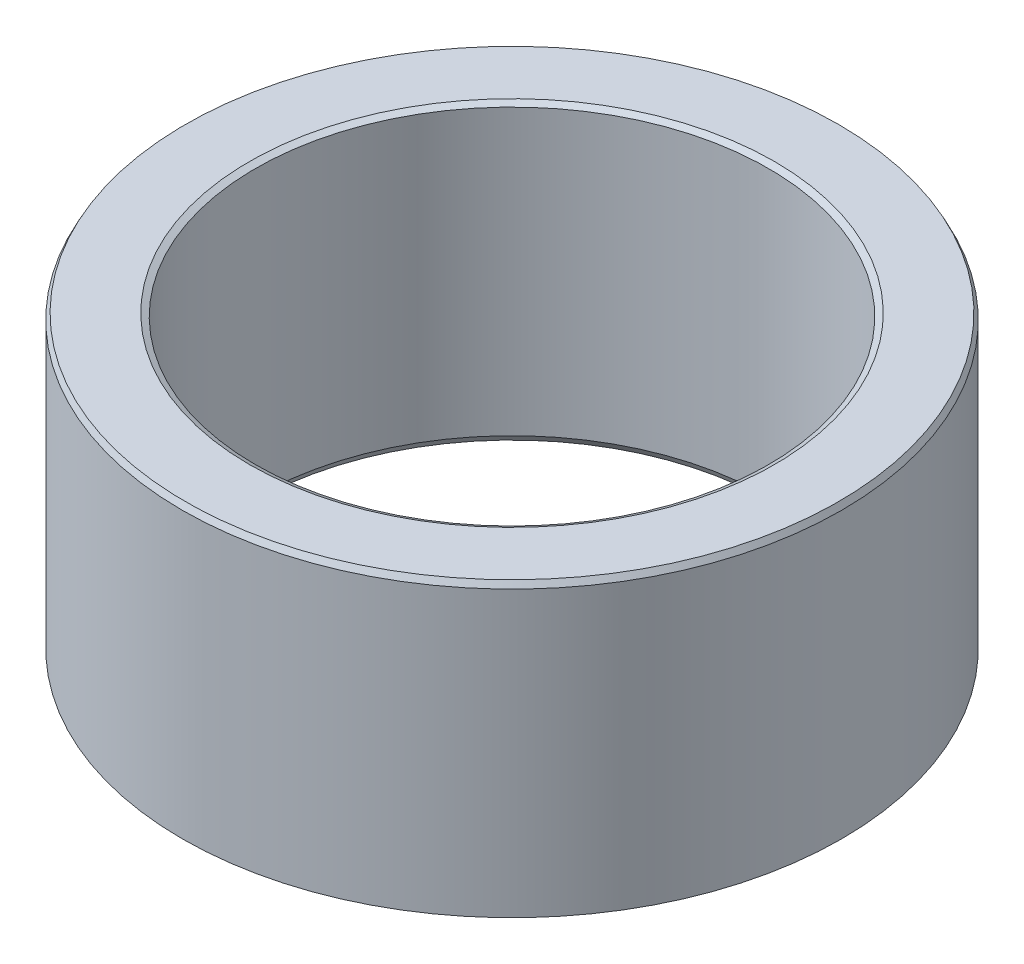
ISO-10303-21;
HEADER;
FILE_DESCRIPTION(('STEP AP214'),'2;1');
FILE_NAME('part.step','',(''),(''),'','','');
FILE_SCHEMA(('AUTOMOTIVE_DESIGN { 1 0 10303 214 1 1 1 1 }'));
ENDSEC;
DATA;
#1=APPLICATION_CONTEXT('core data for automotive mechanical design processes');
#2=APPLICATION_PROTOCOL_DEFINITION('international standard','automotive_design',2000,#1);
#3=PRODUCT_CONTEXT('',#1,'mechanical');
#4=PRODUCT('Part','Part','',(#3));
#5=PRODUCT_RELATED_PRODUCT_CATEGORY('part','',(#4));
#6=PRODUCT_DEFINITION_FORMATION('','',#4);
#7=PRODUCT_DEFINITION_CONTEXT('part definition',#1,'design');
#8=PRODUCT_DEFINITION('design','',#6,#7);
#9=PRODUCT_DEFINITION_SHAPE('','',#8);
#10=(LENGTH_UNIT() NAMED_UNIT(*) SI_UNIT(.MILLI.,.METRE.));
#11=(NAMED_UNIT(*) PLANE_ANGLE_UNIT() SI_UNIT($,.RADIAN.));
#12=(NAMED_UNIT(*) SI_UNIT($,.STERADIAN.) SOLID_ANGLE_UNIT());
#13=UNCERTAINTY_MEASURE_WITH_UNIT(LENGTH_MEASURE(1.E-05),#10,'distance_accuracy_value','');
#14=(GEOMETRIC_REPRESENTATION_CONTEXT(3) GLOBAL_UNCERTAINTY_ASSIGNED_CONTEXT((#13)) GLOBAL_UNIT_ASSIGNED_CONTEXT((#10,
#11,#12)) REPRESENTATION_CONTEXT('',''));
#15=CARTESIAN_POINT('',(0.,0.,0.));
#16=DIRECTION('',(0.,0.,1.));
#17=DIRECTION('',(1.,0.,0.));
#18=AXIS2_PLACEMENT_3D('',#15,#16,#17);
#19=CARTESIAN_POINT('',(0.,26.7156159370592,0.));
#20=DIRECTION('',(0.,-1.,0.));
#21=DIRECTION('',(0.,0.,-1.));
#22=AXIS2_PLACEMENT_3D('',#19,#20,#21);
#23=CYLINDRICAL_SURFACE('',#22,30.);
#24=CARTESIAN_POINT('',(0.,0.277808057925648,0.));
#25=DIRECTION('',(0.,1.,0.));
#26=DIRECTION('',(0.,0.,1.));
#27=AXIS2_PLACEMENT_3D('',#24,#25,#26);
#28=CIRCLE('',#27,30.);
#29=CARTESIAN_POINT('',(0.,0.277808057925648,30.));
#30=VERTEX_POINT('',#29);
#31=EDGE_CURVE('E10',#30,#30,#28,.T.);
#32=ORIENTED_EDGE('',*,*,#31,.T.);
#33=EDGE_LOOP('',(#32));
#34=FACE_BOUND('',#33,.T.);
#35=CARTESIAN_POINT('',(0.,26.1721010701166,0.));
#36=DIRECTION('',(0.,1.,0.));
#37=DIRECTION('',(0.,0.,1.));
#38=AXIS2_PLACEMENT_3D('',#35,#36,#37);
#39=CIRCLE('',#38,30.);
#40=CARTESIAN_POINT('',(0.,26.1721010701166,-30.));
#41=VERTEX_POINT('',#40);
#42=EDGE_CURVE('E50',#41,#41,#39,.F.);
#43=ORIENTED_EDGE('',*,*,#42,.T.);
#44=EDGE_LOOP('',(#43));
#45=FACE_BOUND('',#44,.T.);
#46=ADVANCED_FACE('F39',(#34,#45),#23,.T.);
#47=CARTESIAN_POINT('',(0.,26.7156159370592,0.));
#48=DIRECTION('',(0.,1.,0.));
#49=DIRECTION('',(0.,0.,1.));
#50=AXIS2_PLACEMENT_3D('',#47,#48,#49);
#51=PLANE('',#50);
#52=CARTESIAN_POINT('',(0.,26.7156159370592,0.));
#53=DIRECTION('',(0.,1.,0.));
#54=DIRECTION('',(0.,0.,1.));
#55=AXIS2_PLACEMENT_3D('',#52,#53,#54);
#56=CIRCLE('',#55,23.8874839392148);
#57=CARTESIAN_POINT('',(0.,26.7156159370592,23.8874839392148));
#58=VERTEX_POINT('',#57);
#59=EDGE_CURVE('E58',#58,#58,#56,.F.);
#60=ORIENTED_EDGE('',*,*,#59,.T.);
#61=EDGE_LOOP('',(#60));
#62=FACE_BOUND('',#61,.T.);
#63=CARTESIAN_POINT('',(0.,26.7156159370592,0.));
#64=DIRECTION('',(0.,1.,0.));
#65=DIRECTION('',(0.,0.,1.));
#66=AXIS2_PLACEMENT_3D('',#63,#64,#65);
#67=CIRCLE('',#66,29.7221919420743);
#68=CARTESIAN_POINT('',(0.,26.7156159370592,-29.7221919420743));
#69=VERTEX_POINT('',#68);
#70=EDGE_CURVE('E61',#69,#69,#67,.T.);
#71=ORIENTED_EDGE('',*,*,#70,.T.);
#72=EDGE_LOOP('',(#71));
#73=FACE_BOUND('',#72,.T.);
#74=ADVANCED_FACE('F88',(#62,#73),#51,.T.);
#75=CARTESIAN_POINT('',(0.,0.,0.));
#76=DIRECTION('',(0.,1.,0.));
#77=DIRECTION('',(0.,0.,1.));
#78=AXIS2_PLACEMENT_3D('',#75,#76,#77);
#79=PLANE('',#78);
#80=CARTESIAN_POINT('',(0.,0.,0.));
#81=DIRECTION('',(0.,1.,0.));
#82=DIRECTION('',(0.,0.,1.));
#83=AXIS2_PLACEMENT_3D('',#80,#81,#82);
#84=CIRCLE('',#83,23.621777130198);
#85=CARTESIAN_POINT('',(0.,0.,23.621777130198));
#86=VERTEX_POINT('',#85);
#87=EDGE_CURVE('E51',#86,#86,#84,.T.);
#88=ORIENTED_EDGE('',*,*,#87,.T.);
#89=EDGE_LOOP('',(#88));
#90=FACE_BOUND('',#89,.T.);
#91=CARTESIAN_POINT('',(0.,0.,0.));
#92=DIRECTION('',(0.,1.,0.));
#93=DIRECTION('',(0.,0.,1.));
#94=AXIS2_PLACEMENT_3D('',#91,#92,#93);
#95=CIRCLE('',#94,29.4564851330575);
#96=CARTESIAN_POINT('',(0.,0.,29.4564851330575));
#97=VERTEX_POINT('',#96);
#98=EDGE_CURVE('E54',#97,#97,#95,.F.);
#99=ORIENTED_EDGE('',*,*,#98,.T.);
#100=EDGE_LOOP('',(#99));
#101=FACE_BOUND('',#100,.T.);
#102=ADVANCED_FACE('F83',(#90,#101),#79,.F.);
#103=CARTESIAN_POINT('',(0.,26.7156159370592,0.));
#104=DIRECTION('',(0.,-1.,0.));
#105=DIRECTION('',(0.,0.,-1.));
#106=AXIS2_PLACEMENT_3D('',#103,#104,#105);
#107=CYLINDRICAL_SURFACE('',#106,23.3439690722724);
#108=CARTESIAN_POINT('',(0.,26.4378078791335,0.));
#109=DIRECTION('',(0.,1.,0.));
#110=DIRECTION('',(0.,0.,1.));
#111=AXIS2_PLACEMENT_3D('',#108,#109,#110);
#112=CIRCLE('',#111,23.3439690722724);
#113=CARTESIAN_POINT('',(0.,26.4378078791335,23.3439690722724));
#114=VERTEX_POINT('',#113);
#115=EDGE_CURVE('E67',#114,#114,#112,.T.);
#116=ORIENTED_EDGE('',*,*,#115,.T.);
#117=EDGE_LOOP('',(#116));
#118=FACE_BOUND('',#117,.T.);
#119=CARTESIAN_POINT('',(0.,0.543514866942471,0.));
#120=DIRECTION('',(0.,1.,0.));
#121=DIRECTION('',(0.,0.,1.));
#122=AXIS2_PLACEMENT_3D('',#119,#120,#121);
#123=CIRCLE('',#122,23.3439690722724);
#124=CARTESIAN_POINT('',(0.,0.543514866942471,23.3439690722724));
#125=VERTEX_POINT('',#124);
#126=EDGE_CURVE('E69',#125,#125,#123,.F.);
#127=ORIENTED_EDGE('',*,*,#126,.T.);
#128=EDGE_LOOP('',(#127));
#129=FACE_BOUND('',#128,.T.);
#130=ADVANCED_FACE('F71',(#118,#129),#107,.F.);
#131=CARTESIAN_POINT('',(0.,26.4378078791335,0.));
#132=DIRECTION('',(0.,1.,0.));
#133=DIRECTION('',(0.,0.,1.));
#134=AXIS2_PLACEMENT_3D('',#131,#132,#133);
#135=CONICAL_SURFACE('',#134,23.3439690722724,1.09828251267554);
#136=ORIENTED_EDGE('',*,*,#59,.F.);
#137=EDGE_LOOP('',(#136));
#138=FACE_BOUND('',#137,.T.);
#139=ORIENTED_EDGE('',*,*,#115,.F.);
#140=EDGE_LOOP('',(#139));
#141=FACE_BOUND('',#140,.T.);
#142=ADVANCED_FACE('F77',(#138,#141),#135,.F.);
#143=CARTESIAN_POINT('',(0.,0.,0.));
#144=DIRECTION('',(0.,-1.,0.));
#145=DIRECTION('',(0.,0.,-1.));
#146=AXIS2_PLACEMENT_3D('',#143,#144,#145);
#147=CONICAL_SURFACE('',#146,23.621777130198,0.472513814119369);
#148=ORIENTED_EDGE('',*,*,#126,.F.);
#149=EDGE_LOOP('',(#148));
#150=FACE_BOUND('',#149,.T.);
#151=ORIENTED_EDGE('',*,*,#87,.F.);
#152=EDGE_LOOP('',(#151));
#153=FACE_BOUND('',#152,.T.);
#154=ADVANCED_FACE('F73',(#150,#153),#147,.F.);
#155=CARTESIAN_POINT('',(0.,0.277808057925648,0.));
#156=DIRECTION('',(0.,1.,0.));
#157=DIRECTION('',(0.,0.,1.));
#158=AXIS2_PLACEMENT_3D('',#155,#156,#157);
#159=CONICAL_SURFACE('',#158,30.,1.09828251267554);
#160=ORIENTED_EDGE('',*,*,#98,.F.);
#161=EDGE_LOOP('',(#160));
#162=FACE_BOUND('',#161,.T.);
#163=ORIENTED_EDGE('',*,*,#31,.F.);
#164=EDGE_LOOP('',(#163));
#165=FACE_BOUND('',#164,.T.);
#166=ADVANCED_FACE('F76',(#162,#165),#159,.T.);
#167=CARTESIAN_POINT('',(0.,26.7156159370592,0.));
#168=DIRECTION('',(0.,-1.,0.));
#169=DIRECTION('',(0.,0.,-1.));
#170=AXIS2_PLACEMENT_3D('',#167,#168,#169);
#171=CONICAL_SURFACE('',#170,29.7221919420743,0.472513814119353);
#172=CARTESIAN_POINT('',(0.,26.1721010701166,-30.));
#173=CARTESIAN_POINT('',(0.,26.1777626833139,-29.9971061660633));
#174=CARTESIAN_POINT('',(0.,26.1834242965113,-29.9942123321265));
#175=CARTESIAN_POINT('',(0.,26.1947475229059,-29.9884246642531));
#176=CARTESIAN_POINT('',(0.,26.2004091361032,-29.9855308303164));
#177=CARTESIAN_POINT('',(0.,26.2117323624979,-29.9797431624429));
#178=CARTESIAN_POINT('',(0.,26.2173939756952,-29.9768493285062));
#179=CARTESIAN_POINT('',(0.,26.2287172020898,-29.9710616606327));
#180=CARTESIAN_POINT('',(0.,26.2343788152871,-29.968167826696));
#181=CARTESIAN_POINT('',(0.,26.2457020416818,-29.9623801588226));
#182=CARTESIAN_POINT('',(0.,26.2513636548791,-29.9594863248858));
#183=CARTESIAN_POINT('',(0.,26.2626868812737,-29.9536986570124));
#184=CARTESIAN_POINT('',(0.,26.268348494471,-29.9508048230757));
#185=CARTESIAN_POINT('',(0.,26.2796717208657,-29.9450171552022));
#186=CARTESIAN_POINT('',(0.,26.285333334063,-29.9421233212655));
#187=CARTESIAN_POINT('',(0.,26.2966565604576,-29.936335653392));
#188=CARTESIAN_POINT('',(0.,26.3023181736549,-29.9334418194553));
#189=CARTESIAN_POINT('',(0.,26.3136414000496,-29.9276541515819));
#190=CARTESIAN_POINT('',(0.,26.3193030132469,-29.9247603176451));
#191=CARTESIAN_POINT('',(0.,26.3306262396415,-29.9189726497717));
#192=CARTESIAN_POINT('',(0.,26.3362878528388,-29.916078815835));
#193=CARTESIAN_POINT('',(0.,26.3476110792335,-29.9102911479615));
#194=CARTESIAN_POINT('',(0.,26.3532726924308,-29.9073973140248));
#195=CARTESIAN_POINT('',(0.,26.3645959188254,-29.9016096461513));
#196=CARTESIAN_POINT('',(0.,26.3702575320228,-29.8987158122146));
#197=CARTESIAN_POINT('',(0.,26.3815807584174,-29.8929281443411));
#198=CARTESIAN_POINT('',(0.,26.3872423716147,-29.8900343104044));
#199=CARTESIAN_POINT('',(0.,26.3985655980093,-29.884246642531));
#200=CARTESIAN_POINT('',(0.,26.4042272112067,-29.8813528085942));
#201=CARTESIAN_POINT('',(0.,26.4155504376013,-29.8755651407208));
#202=CARTESIAN_POINT('',(0.,26.4212120507986,-29.8726713067841));
#203=CARTESIAN_POINT('',(0.,26.4325352771933,-29.8668836389106));
#204=CARTESIAN_POINT('',(0.,26.4381968903906,-29.8639898049739));
#205=CARTESIAN_POINT('',(0.,26.4495201167852,-29.8582021371004));
#206=CARTESIAN_POINT('',(0.,26.4551817299825,-29.8553083031637));
#207=CARTESIAN_POINT('',(0.,26.4665049563772,-29.8495206352903));
#208=CARTESIAN_POINT('',(0.,26.4721665695745,-29.8466268013535));
#209=CARTESIAN_POINT('',(0.,26.4834897959691,-29.8408391334801));
#210=CARTESIAN_POINT('',(0.,26.4891514091664,-29.8379452995434));
#211=CARTESIAN_POINT('',(0.,26.5004746355611,-29.8321576316699));
#212=CARTESIAN_POINT('',(0.,26.5061362487584,-29.8292637977332));
#213=CARTESIAN_POINT('',(0.,26.517459475153,-29.8234761298597));
#214=CARTESIAN_POINT('',(0.,26.5231210883503,-29.820582295923));
#215=CARTESIAN_POINT('',(0.,26.534444314745,-29.8147946280496));
#216=CARTESIAN_POINT('',(0.,26.5401059279423,-29.8119007941128));
#217=CARTESIAN_POINT('',(0.,26.5514291543369,-29.8061131262394));
#218=CARTESIAN_POINT('',(0.,26.5570907675342,-29.8032192923026));
#219=CARTESIAN_POINT('',(0.,26.5684139939289,-29.7974316244292));
#220=CARTESIAN_POINT('',(0.,26.5740756071262,-29.7945377904925));
#221=CARTESIAN_POINT('',(0.,26.5853988335208,-29.788750122619));
#222=CARTESIAN_POINT('',(0.,26.5910604467182,-29.7858562886823));
#223=CARTESIAN_POINT('',(0.,26.6023836731128,-29.7800686208088));
#224=CARTESIAN_POINT('',(0.,26.6080452863101,-29.7771747868721));
#225=CARTESIAN_POINT('',(0.,26.6193685127047,-29.7713871189987));
#226=CARTESIAN_POINT('',(0.,26.6250301259021,-29.7684932850619));
#227=CARTESIAN_POINT('',(0.,26.6363533522967,-29.7627056171885));
#228=CARTESIAN_POINT('',(0.,26.642014965494,-29.7598117832518));
#229=CARTESIAN_POINT('',(0.,26.6533381918887,-29.7540241153783));
#230=CARTESIAN_POINT('',(0.,26.658999805086,-29.7511302814416));
#231=CARTESIAN_POINT('',(0.,26.6703230314806,-29.7453426135681));
#232=CARTESIAN_POINT('',(0.,26.6759846446779,-29.7424487796314));
#233=CARTESIAN_POINT('',(0.,26.6873078710726,-29.736661111758));
#234=CARTESIAN_POINT('',(0.,26.6929694842699,-29.7337672778212));
#235=CARTESIAN_POINT('',(0.,26.7042927106645,-29.7279796099478));
#236=CARTESIAN_POINT('',(0.,26.7099543238618,-29.725085776011));
#237=CARTESIAN_POINT('',(0.,26.7156159370592,-29.7221919420743));
#238=B_SPLINE_CURVE_WITH_KNOTS('',3,(#172,#173,#174,#175,#176,#177,#178,#179,#180,#181,#182,
#183,#184,#185,#186,#187,#188,#189,#190,#191,#192,#193,#194,#195,#196,#197,#198,#199,#200,#201,
#202,#203,#204,#205,#206,#207,#208,#209,#210,#211,#212,#213,#214,#215,#216,#217,#218,#219,#220,
#221,#222,#223,#224,#225,#226,#227,#228,#229,#230,#231,#232,#233,#234,#235,#236,#237),
.UNSPECIFIED.,.F.,.F.,(4,2,2,2,2,2,2,2,2,2,2,2,2,2,2,2,2,2,2,2,2,2,2,2,2,2,2,2,2,2,2,2,4),(0.,
0.0190749377363195,0.0381498754726389,0.0572248132089615,0.0762997509452809,0.0953746886816019,
0.114449626417924,0.133524564154244,0.152599501890566,0.171674439626886,0.190749377363205,
0.209824315099528,0.228899252835849,0.247974190572168,0.267049128308491,0.28612406604481,
0.305199003781133,0.324273941517453,0.343348879253774,0.362423816990096,0.381498754726416,
0.400573692462735,0.419648630199058,0.438723567935377,0.4577985056717,0.476873443408021,
0.49594838114434,0.515023318880663,0.534098256616982,0.553173194353302,0.572248132089624,
0.591323069825945,0.610398007562268),.UNSPECIFIED.);
#239=EDGE_CURVE('BSEAM45',#41,#69,#238,.T.);
#240=ORIENTED_EDGE('',*,*,#42,.F.);
#241=ORIENTED_EDGE('',*,*,#70,.F.);
#242=ORIENTED_EDGE('',*,*,#239,.T.);
#243=ORIENTED_EDGE('',*,*,#239,.F.);
#244=EDGE_LOOP('',(#240,#242,#241,#243));
#245=FACE_BOUND('',#244,.T.);
#246=ADVANCED_FACE('F45',(#245),#171,.T.);
#247=CLOSED_SHELL('',(#46,#74,#102,#130,#142,#154,#166,#246));
#248=MANIFOLD_SOLID_BREP('B2',#247);
#249=ADVANCED_BREP_SHAPE_REPRESENTATION('',(#18,#248),#14);
#250=SHAPE_DEFINITION_REPRESENTATION(#9,#249);
ENDSEC;
END-ISO-10303-21;
